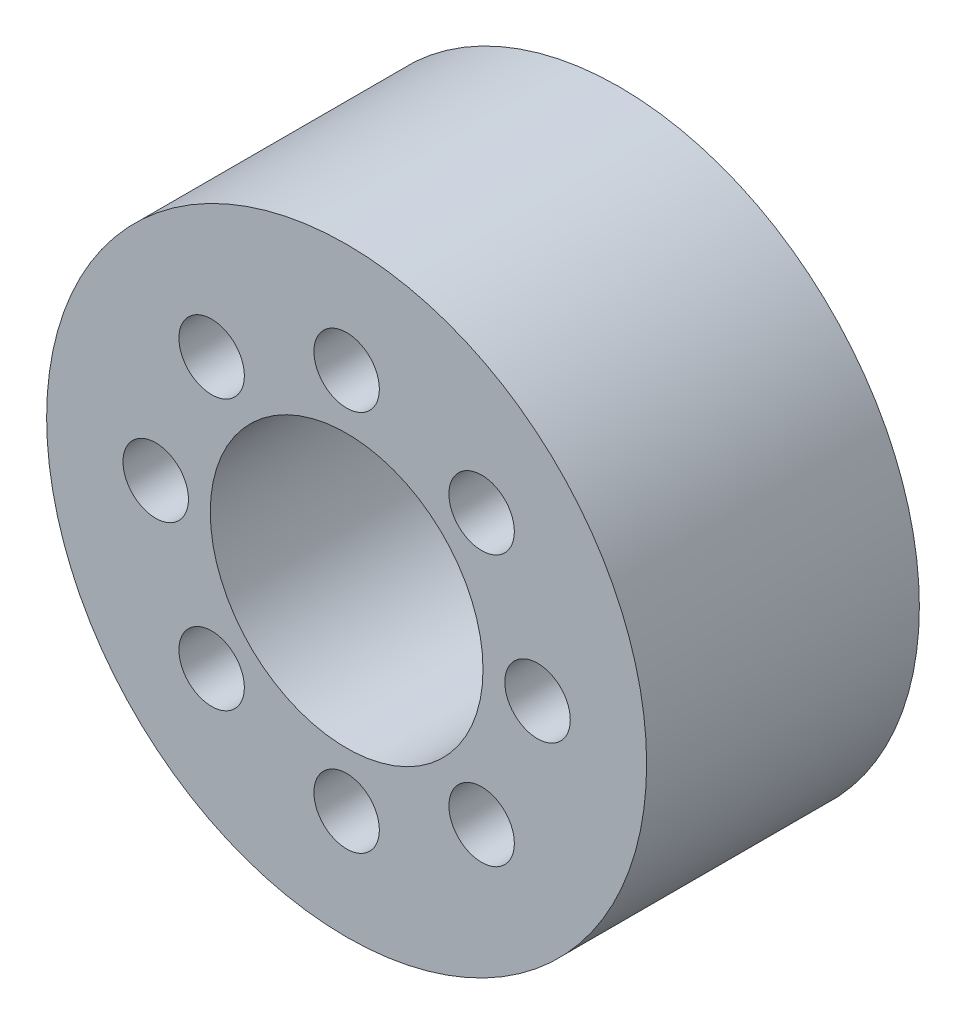
ISO-10303-21;
HEADER;
FILE_DESCRIPTION(('STEP AP214'),'2;1');
FILE_NAME('part.step','',(''),(''),'','','');
FILE_SCHEMA(('AUTOMOTIVE_DESIGN { 1 0 10303 214 1 1 1 1 }'));
ENDSEC;
DATA;
#1=APPLICATION_CONTEXT('core data for automotive mechanical design processes');
#2=APPLICATION_PROTOCOL_DEFINITION('international standard','automotive_design',2000,#1);
#3=PRODUCT_CONTEXT('',#1,'mechanical');
#4=PRODUCT('Part','Part','',(#3));
#5=PRODUCT_RELATED_PRODUCT_CATEGORY('part','',(#4));
#6=PRODUCT_DEFINITION_FORMATION('','',#4);
#7=PRODUCT_DEFINITION_CONTEXT('part definition',#1,'design');
#8=PRODUCT_DEFINITION('design','',#6,#7);
#9=PRODUCT_DEFINITION_SHAPE('','',#8);
#10=(LENGTH_UNIT() NAMED_UNIT(*) SI_UNIT(.MILLI.,.METRE.));
#11=(NAMED_UNIT(*) PLANE_ANGLE_UNIT() SI_UNIT($,.RADIAN.));
#12=(NAMED_UNIT(*) SI_UNIT($,.STERADIAN.) SOLID_ANGLE_UNIT());
#13=UNCERTAINTY_MEASURE_WITH_UNIT(LENGTH_MEASURE(1.E-05),#10,'distance_accuracy_value','');
#14=(GEOMETRIC_REPRESENTATION_CONTEXT(3) GLOBAL_UNCERTAINTY_ASSIGNED_CONTEXT((#13)) GLOBAL_UNIT_ASSIGNED_CONTEXT((#10,
#11,#12)) REPRESENTATION_CONTEXT('',''));
#15=CARTESIAN_POINT('',(0.,0.,0.));
#16=DIRECTION('',(0.,0.,1.));
#17=DIRECTION('',(1.,0.,0.));
#18=AXIS2_PLACEMENT_3D('',#15,#16,#17);
#19=CARTESIAN_POINT('',(0.,0.,10.));
#20=DIRECTION('',(0.,0.,1.));
#21=DIRECTION('',(1.,0.,0.));
#22=AXIS2_PLACEMENT_3D('',#19,#20,#21);
#23=PLANE('',#22);
#24=CARTESIAN_POINT('',(0.,7.,10.));
#25=DIRECTION('',(0.,0.,1.));
#26=DIRECTION('',(1.,0.,0.));
#27=AXIS2_PLACEMENT_3D('',#24,#25,#26);
#28=CIRCLE('',#27,1.2);
#29=CARTESIAN_POINT('',(1.2,7.,10.));
#30=VERTEX_POINT('',#29);
#31=EDGE_CURVE('E94',#30,#30,#28,.T.);
#32=ORIENTED_EDGE('',*,*,#31,.F.);
#33=EDGE_LOOP('',(#32));
#34=FACE_BOUND('',#33,.T.);
#35=CARTESIAN_POINT('',(4.94974746830584,4.94974746830583,10.));
#36=DIRECTION('',(0.,0.,1.));
#37=DIRECTION('',(1.,0.,0.));
#38=AXIS2_PLACEMENT_3D('',#35,#36,#37);
#39=CIRCLE('',#38,1.2);
#40=CARTESIAN_POINT('',(6.14974746830584,4.94974746830583,10.));
#41=VERTEX_POINT('',#40);
#42=EDGE_CURVE('E88',#41,#41,#39,.T.);
#43=ORIENTED_EDGE('',*,*,#42,.F.);
#44=EDGE_LOOP('',(#43));
#45=FACE_BOUND('',#44,.T.);
#46=CARTESIAN_POINT('',(7.0000000000002,1.98094713253425E-13,10.));
#47=DIRECTION('',(0.,0.,1.));
#48=DIRECTION('',(1.,0.,0.));
#49=AXIS2_PLACEMENT_3D('',#46,#47,#48);
#50=CIRCLE('',#49,1.2);
#51=CARTESIAN_POINT('',(8.2000000000002,1.98094713253425E-13,10.));
#52=VERTEX_POINT('',#51);
#53=EDGE_CURVE('E82',#52,#52,#50,.T.);
#54=ORIENTED_EDGE('',*,*,#53,.F.);
#55=EDGE_LOOP('',(#54));
#56=FACE_BOUND('',#55,.T.);
#57=CARTESIAN_POINT('',(4.94974746830617,-4.94974746830569,10.));
#58=DIRECTION('',(0.,0.,1.));
#59=DIRECTION('',(1.,0.,0.));
#60=AXIS2_PLACEMENT_3D('',#57,#58,#59);
#61=CIRCLE('',#60,1.2);
#62=CARTESIAN_POINT('',(6.14974746830617,-4.94974746830569,10.));
#63=VERTEX_POINT('',#62);
#64=EDGE_CURVE('E76',#63,#63,#61,.T.);
#65=ORIENTED_EDGE('',*,*,#64,.F.);
#66=EDGE_LOOP('',(#65));
#67=FACE_BOUND('',#66,.T.);
#68=CARTESIAN_POINT('',(3.9618942650685E-13,-7.,10.));
#69=DIRECTION('',(0.,0.,1.));
#70=DIRECTION('',(1.,0.,0.));
#71=AXIS2_PLACEMENT_3D('',#68,#69,#70);
#72=CIRCLE('',#71,1.2);
#73=CARTESIAN_POINT('',(1.2000000000004,-7.,10.));
#74=VERTEX_POINT('',#73);
#75=EDGE_CURVE('E70',#74,#74,#72,.T.);
#76=ORIENTED_EDGE('',*,*,#75,.F.);
#77=EDGE_LOOP('',(#76));
#78=FACE_BOUND('',#77,.T.);
#79=CARTESIAN_POINT('',(-4.9497474683055,-4.94974746830597,10.));
#80=DIRECTION('',(0.,0.,1.));
#81=DIRECTION('',(1.,0.,0.));
#82=AXIS2_PLACEMENT_3D('',#79,#80,#81);
#83=CIRCLE('',#82,1.2);
#84=CARTESIAN_POINT('',(-3.7497474683055,-4.94974746830597,10.));
#85=VERTEX_POINT('',#84);
#86=EDGE_CURVE('E64',#85,#85,#83,.T.);
#87=ORIENTED_EDGE('',*,*,#86,.F.);
#88=EDGE_LOOP('',(#87));
#89=FACE_BOUND('',#88,.T.);
#90=CARTESIAN_POINT('',(-6.9999999999998,-1.98951966012828E-13,10.));
#91=DIRECTION('',(0.,0.,1.));
#92=DIRECTION('',(1.,0.,0.));
#93=AXIS2_PLACEMENT_3D('',#90,#91,#92);
#94=CIRCLE('',#93,1.2);
#95=CARTESIAN_POINT('',(-5.7999999999998,-1.98951966012828E-13,10.));
#96=VERTEX_POINT('',#95);
#97=EDGE_CURVE('E58',#96,#96,#94,.T.);
#98=ORIENTED_EDGE('',*,*,#97,.F.);
#99=EDGE_LOOP('',(#98));
#100=FACE_BOUND('',#99,.T.);
#101=CARTESIAN_POINT('',(-4.94974746830577,4.94974746830569,10.));
#102=DIRECTION('',(0.,0.,1.));
#103=DIRECTION('',(1.,0.,0.));
#104=AXIS2_PLACEMENT_3D('',#101,#102,#103);
#105=CIRCLE('',#104,1.2);
#106=CARTESIAN_POINT('',(-3.74974746830578,4.94974746830569,10.));
#107=VERTEX_POINT('',#106);
#108=EDGE_CURVE('E52',#107,#107,#105,.T.);
#109=ORIENTED_EDGE('',*,*,#108,.F.);
#110=EDGE_LOOP('',(#109));
#111=FACE_BOUND('',#110,.T.);
#112=CARTESIAN_POINT('',(0.,0.,10.));
#113=DIRECTION('',(0.,0.,1.));
#114=DIRECTION('',(1.,0.,0.));
#115=AXIS2_PLACEMENT_3D('',#112,#113,#114);
#116=CIRCLE('',#115,11.);
#117=CARTESIAN_POINT('',(11.,0.,10.));
#118=VERTEX_POINT('',#117);
#119=EDGE_CURVE('E10',#118,#118,#116,.T.);
#120=ORIENTED_EDGE('',*,*,#119,.T.);
#121=EDGE_LOOP('',(#120));
#122=FACE_BOUND('',#121,.T.);
#123=CARTESIAN_POINT('',(0.,0.,10.));
#124=DIRECTION('',(0.,0.,1.));
#125=DIRECTION('',(1.,0.,0.));
#126=AXIS2_PLACEMENT_3D('',#123,#124,#125);
#127=CIRCLE('',#126,5.);
#128=CARTESIAN_POINT('',(5.,0.,10.));
#129=VERTEX_POINT('',#128);
#130=EDGE_CURVE('E42',#129,#129,#127,.T.);
#131=ORIENTED_EDGE('',*,*,#130,.F.);
#132=EDGE_LOOP('',(#131));
#133=FACE_BOUND('',#132,.T.);
#134=ADVANCED_FACE('F31',(#34,#45,#56,#67,#78,#89,#100,#111,#122,#133),#23,.T.);
#135=CARTESIAN_POINT('',(0.,0.,0.));
#136=DIRECTION('',(0.,0.,1.));
#137=DIRECTION('',(1.,0.,0.));
#138=AXIS2_PLACEMENT_3D('',#135,#136,#137);
#139=PLANE('',#138);
#140=CARTESIAN_POINT('',(0.,7.,0.));
#141=DIRECTION('',(0.,0.,1.));
#142=DIRECTION('',(1.,0.,0.));
#143=AXIS2_PLACEMENT_3D('',#140,#141,#142);
#144=CIRCLE('',#143,1.2);
#145=CARTESIAN_POINT('',(1.2,7.,0.));
#146=VERTEX_POINT('',#145);
#147=EDGE_CURVE('E91',#146,#146,#144,.T.);
#148=ORIENTED_EDGE('',*,*,#147,.T.);
#149=EDGE_LOOP('',(#148));
#150=FACE_BOUND('',#149,.T.);
#151=CARTESIAN_POINT('',(4.94974746830584,4.94974746830583,0.));
#152=DIRECTION('',(0.,0.,1.));
#153=DIRECTION('',(1.,0.,0.));
#154=AXIS2_PLACEMENT_3D('',#151,#152,#153);
#155=CIRCLE('',#154,1.2);
#156=CARTESIAN_POINT('',(6.14974746830584,4.94974746830583,0.));
#157=VERTEX_POINT('',#156);
#158=EDGE_CURVE('E85',#157,#157,#155,.T.);
#159=ORIENTED_EDGE('',*,*,#158,.T.);
#160=EDGE_LOOP('',(#159));
#161=FACE_BOUND('',#160,.T.);
#162=CARTESIAN_POINT('',(7.0000000000002,1.98094713253425E-13,0.));
#163=DIRECTION('',(0.,0.,1.));
#164=DIRECTION('',(1.,0.,0.));
#165=AXIS2_PLACEMENT_3D('',#162,#163,#164);
#166=CIRCLE('',#165,1.2);
#167=CARTESIAN_POINT('',(8.2000000000002,1.98094713253425E-13,0.));
#168=VERTEX_POINT('',#167);
#169=EDGE_CURVE('E79',#168,#168,#166,.T.);
#170=ORIENTED_EDGE('',*,*,#169,.T.);
#171=EDGE_LOOP('',(#170));
#172=FACE_BOUND('',#171,.T.);
#173=CARTESIAN_POINT('',(4.94974746830617,-4.94974746830569,0.));
#174=DIRECTION('',(0.,0.,1.));
#175=DIRECTION('',(1.,0.,0.));
#176=AXIS2_PLACEMENT_3D('',#173,#174,#175);
#177=CIRCLE('',#176,1.2);
#178=CARTESIAN_POINT('',(6.14974746830617,-4.94974746830569,0.));
#179=VERTEX_POINT('',#178);
#180=EDGE_CURVE('E73',#179,#179,#177,.T.);
#181=ORIENTED_EDGE('',*,*,#180,.T.);
#182=EDGE_LOOP('',(#181));
#183=FACE_BOUND('',#182,.T.);
#184=CARTESIAN_POINT('',(3.9618942650685E-13,-7.,0.));
#185=DIRECTION('',(0.,0.,1.));
#186=DIRECTION('',(1.,0.,0.));
#187=AXIS2_PLACEMENT_3D('',#184,#185,#186);
#188=CIRCLE('',#187,1.2);
#189=CARTESIAN_POINT('',(1.20000000000039,-7.,0.));
#190=VERTEX_POINT('',#189);
#191=EDGE_CURVE('E67',#190,#190,#188,.T.);
#192=ORIENTED_EDGE('',*,*,#191,.T.);
#193=EDGE_LOOP('',(#192));
#194=FACE_BOUND('',#193,.T.);
#195=CARTESIAN_POINT('',(-4.9497474683055,-4.94974746830597,0.));
#196=DIRECTION('',(0.,0.,1.));
#197=DIRECTION('',(1.,0.,0.));
#198=AXIS2_PLACEMENT_3D('',#195,#196,#197);
#199=CIRCLE('',#198,1.2);
#200=CARTESIAN_POINT('',(-3.7497474683055,-4.94974746830597,0.));
#201=VERTEX_POINT('',#200);
#202=EDGE_CURVE('E61',#201,#201,#199,.T.);
#203=ORIENTED_EDGE('',*,*,#202,.T.);
#204=EDGE_LOOP('',(#203));
#205=FACE_BOUND('',#204,.T.);
#206=CARTESIAN_POINT('',(-6.9999999999998,-1.98951966012828E-13,0.));
#207=DIRECTION('',(0.,0.,1.));
#208=DIRECTION('',(1.,0.,0.));
#209=AXIS2_PLACEMENT_3D('',#206,#207,#208);
#210=CIRCLE('',#209,1.2);
#211=CARTESIAN_POINT('',(-5.7999999999998,-1.98951966012828E-13,0.));
#212=VERTEX_POINT('',#211);
#213=EDGE_CURVE('E55',#212,#212,#210,.T.);
#214=ORIENTED_EDGE('',*,*,#213,.T.);
#215=EDGE_LOOP('',(#214));
#216=FACE_BOUND('',#215,.T.);
#217=CARTESIAN_POINT('',(-4.94974746830577,4.94974746830569,0.));
#218=DIRECTION('',(0.,0.,1.));
#219=DIRECTION('',(1.,0.,0.));
#220=AXIS2_PLACEMENT_3D('',#217,#218,#219);
#221=CIRCLE('',#220,1.2);
#222=CARTESIAN_POINT('',(-3.74974746830578,4.94974746830569,0.));
#223=VERTEX_POINT('',#222);
#224=EDGE_CURVE('E47',#223,#223,#221,.T.);
#225=ORIENTED_EDGE('',*,*,#224,.T.);
#226=EDGE_LOOP('',(#225));
#227=FACE_BOUND('',#226,.T.);
#228=CARTESIAN_POINT('',(0.,0.,0.));
#229=DIRECTION('',(0.,0.,1.));
#230=DIRECTION('',(1.,0.,0.));
#231=AXIS2_PLACEMENT_3D('',#228,#229,#230);
#232=CIRCLE('',#231,11.);
#233=CARTESIAN_POINT('',(11.,0.,0.));
#234=VERTEX_POINT('',#233);
#235=EDGE_CURVE('E35',#234,#234,#232,.T.);
#236=ORIENTED_EDGE('',*,*,#235,.F.);
#237=EDGE_LOOP('',(#236));
#238=FACE_BOUND('',#237,.T.);
#239=CARTESIAN_POINT('',(0.,0.,0.));
#240=DIRECTION('',(0.,0.,1.));
#241=DIRECTION('',(1.,0.,0.));
#242=AXIS2_PLACEMENT_3D('',#239,#240,#241);
#243=CIRCLE('',#242,5.);
#244=CARTESIAN_POINT('',(5.,0.,0.));
#245=VERTEX_POINT('',#244);
#246=EDGE_CURVE('E44',#245,#245,#243,.T.);
#247=ORIENTED_EDGE('',*,*,#246,.T.);
#248=EDGE_LOOP('',(#247));
#249=FACE_BOUND('',#248,.T.);
#250=ADVANCED_FACE('F102',(#150,#161,#172,#183,#194,#205,#216,#227,#238,#249),#139,.F.);
#251=CARTESIAN_POINT('',(0.,0.,10.));
#252=DIRECTION('',(0.,0.,-1.));
#253=DIRECTION('',(-1.,0.,0.));
#254=AXIS2_PLACEMENT_3D('',#251,#252,#253);
#255=CYLINDRICAL_SURFACE('',#254,11.);
#256=ORIENTED_EDGE('',*,*,#119,.F.);
#257=EDGE_LOOP('',(#256));
#258=FACE_BOUND('',#257,.T.);
#259=ORIENTED_EDGE('',*,*,#235,.T.);
#260=EDGE_LOOP('',(#259));
#261=FACE_BOUND('',#260,.T.);
#262=ADVANCED_FACE('F33',(#258,#261),#255,.T.);
#263=CARTESIAN_POINT('',(0.,0.,10.));
#264=DIRECTION('',(0.,0.,-1.));
#265=DIRECTION('',(-1.,0.,0.));
#266=AXIS2_PLACEMENT_3D('',#263,#264,#265);
#267=CYLINDRICAL_SURFACE('',#266,5.);
#268=ORIENTED_EDGE('',*,*,#130,.T.);
#269=EDGE_LOOP('',(#268));
#270=FACE_BOUND('',#269,.T.);
#271=ORIENTED_EDGE('',*,*,#246,.F.);
#272=EDGE_LOOP('',(#271));
#273=FACE_BOUND('',#272,.T.);
#274=ADVANCED_FACE('F120',(#270,#273),#267,.F.);
#275=CARTESIAN_POINT('',(-4.94974746830577,4.94974746830569,10.));
#276=DIRECTION('',(0.,0.,1.));
#277=DIRECTION('',(1.,0.,0.));
#278=AXIS2_PLACEMENT_3D('',#275,#276,#277);
#279=CYLINDRICAL_SURFACE('',#278,1.2);
#280=ORIENTED_EDGE('',*,*,#224,.F.);
#281=EDGE_LOOP('',(#280));
#282=FACE_BOUND('',#281,.T.);
#283=ORIENTED_EDGE('',*,*,#108,.T.);
#284=EDGE_LOOP('',(#283));
#285=FACE_BOUND('',#284,.T.);
#286=ADVANCED_FACE('F123',(#282,#285),#279,.F.);
#287=CARTESIAN_POINT('',(-6.9999999999998,-1.98951966012828E-13,10.));
#288=DIRECTION('',(0.,0.,1.));
#289=DIRECTION('',(1.,0.,0.));
#290=AXIS2_PLACEMENT_3D('',#287,#288,#289);
#291=CYLINDRICAL_SURFACE('',#290,1.2);
#292=ORIENTED_EDGE('',*,*,#213,.F.);
#293=EDGE_LOOP('',(#292));
#294=FACE_BOUND('',#293,.T.);
#295=ORIENTED_EDGE('',*,*,#97,.T.);
#296=EDGE_LOOP('',(#295));
#297=FACE_BOUND('',#296,.T.);
#298=ADVANCED_FACE('F137',(#294,#297),#291,.F.);
#299=CARTESIAN_POINT('',(-4.9497474683055,-4.94974746830597,10.));
#300=DIRECTION('',(0.,0.,1.));
#301=DIRECTION('',(1.,0.,0.));
#302=AXIS2_PLACEMENT_3D('',#299,#300,#301);
#303=CYLINDRICAL_SURFACE('',#302,1.2);
#304=ORIENTED_EDGE('',*,*,#202,.F.);
#305=EDGE_LOOP('',(#304));
#306=FACE_BOUND('',#305,.T.);
#307=ORIENTED_EDGE('',*,*,#86,.T.);
#308=EDGE_LOOP('',(#307));
#309=FACE_BOUND('',#308,.T.);
#310=ADVANCED_FACE('F141',(#306,#309),#303,.F.);
#311=CARTESIAN_POINT('',(3.9618942650685E-13,-7.,10.));
#312=DIRECTION('',(0.,0.,1.));
#313=DIRECTION('',(1.,0.,0.));
#314=AXIS2_PLACEMENT_3D('',#311,#312,#313);
#315=CYLINDRICAL_SURFACE('',#314,1.2);
#316=ORIENTED_EDGE('',*,*,#191,.F.);
#317=EDGE_LOOP('',(#316));
#318=FACE_BOUND('',#317,.T.);
#319=ORIENTED_EDGE('',*,*,#75,.T.);
#320=EDGE_LOOP('',(#319));
#321=FACE_BOUND('',#320,.T.);
#322=ADVANCED_FACE('F145',(#318,#321),#315,.F.);
#323=CARTESIAN_POINT('',(4.94974746830617,-4.94974746830569,10.));
#324=DIRECTION('',(0.,0.,1.));
#325=DIRECTION('',(1.,0.,0.));
#326=AXIS2_PLACEMENT_3D('',#323,#324,#325);
#327=CYLINDRICAL_SURFACE('',#326,1.2);
#328=ORIENTED_EDGE('',*,*,#180,.F.);
#329=EDGE_LOOP('',(#328));
#330=FACE_BOUND('',#329,.T.);
#331=ORIENTED_EDGE('',*,*,#64,.T.);
#332=EDGE_LOOP('',(#331));
#333=FACE_BOUND('',#332,.T.);
#334=ADVANCED_FACE('F149',(#330,#333),#327,.F.);
#335=CARTESIAN_POINT('',(7.0000000000002,1.98094713253425E-13,10.));
#336=DIRECTION('',(0.,0.,1.));
#337=DIRECTION('',(1.,0.,0.));
#338=AXIS2_PLACEMENT_3D('',#335,#336,#337);
#339=CYLINDRICAL_SURFACE('',#338,1.2);
#340=ORIENTED_EDGE('',*,*,#169,.F.);
#341=EDGE_LOOP('',(#340));
#342=FACE_BOUND('',#341,.T.);
#343=ORIENTED_EDGE('',*,*,#53,.T.);
#344=EDGE_LOOP('',(#343));
#345=FACE_BOUND('',#344,.T.);
#346=ADVANCED_FACE('F153',(#342,#345),#339,.F.);
#347=CARTESIAN_POINT('',(4.94974746830584,4.94974746830583,10.));
#348=DIRECTION('',(0.,0.,1.));
#349=DIRECTION('',(1.,0.,0.));
#350=AXIS2_PLACEMENT_3D('',#347,#348,#349);
#351=CYLINDRICAL_SURFACE('',#350,1.2);
#352=ORIENTED_EDGE('',*,*,#158,.F.);
#353=EDGE_LOOP('',(#352));
#354=FACE_BOUND('',#353,.T.);
#355=ORIENTED_EDGE('',*,*,#42,.T.);
#356=EDGE_LOOP('',(#355));
#357=FACE_BOUND('',#356,.T.);
#358=ADVANCED_FACE('F157',(#354,#357),#351,.F.);
#359=CARTESIAN_POINT('',(0.,7.,10.));
#360=DIRECTION('',(0.,0.,1.));
#361=DIRECTION('',(1.,0.,0.));
#362=AXIS2_PLACEMENT_3D('',#359,#360,#361);
#363=CYLINDRICAL_SURFACE('',#362,1.2);
#364=ORIENTED_EDGE('',*,*,#147,.F.);
#365=EDGE_LOOP('',(#364));
#366=FACE_BOUND('',#365,.T.);
#367=ORIENTED_EDGE('',*,*,#31,.T.);
#368=EDGE_LOOP('',(#367));
#369=FACE_BOUND('',#368,.T.);
#370=ADVANCED_FACE('F98',(#366,#369),#363,.F.);
#371=CLOSED_SHELL('',(#134,#250,#262,#274,#286,#298,#310,#322,#334,#346,#358,#370));
#372=MANIFOLD_SOLID_BREP('B2',#371);
#373=ADVANCED_BREP_SHAPE_REPRESENTATION('',(#18,#372),#14);
#374=SHAPE_DEFINITION_REPRESENTATION(#9,#373);
ENDSEC;
END-ISO-10303-21;
